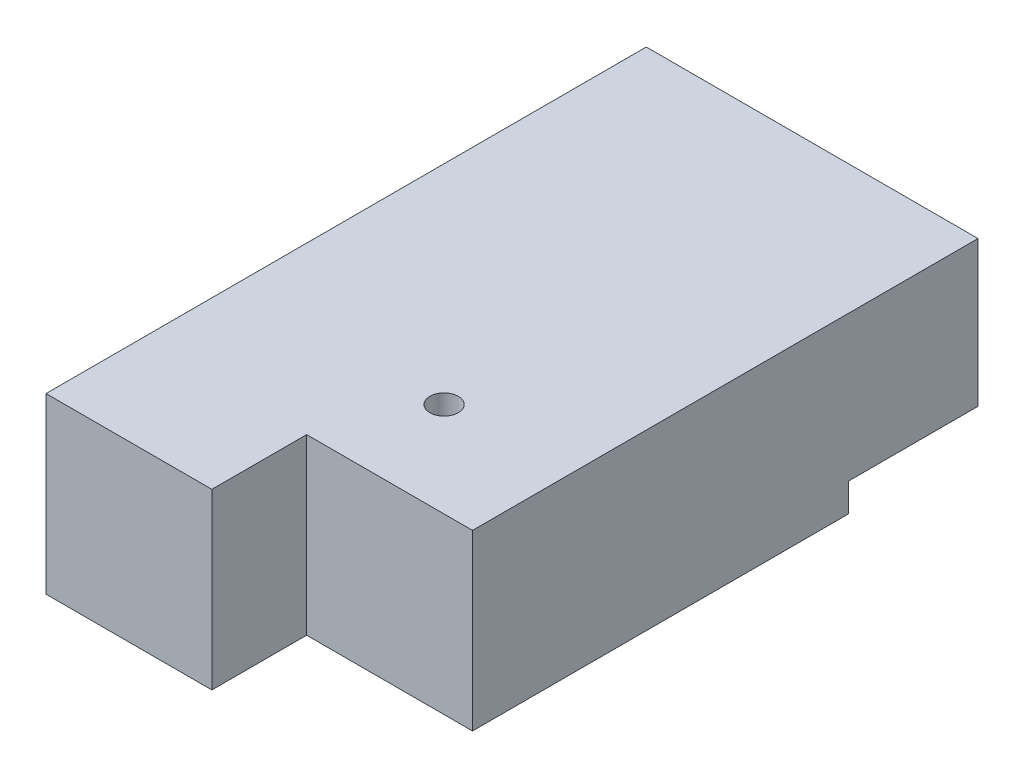
ISO-10303-21;
HEADER;
FILE_DESCRIPTION(('STEP AP214'),'2;1');
FILE_NAME('part.step','',(''),(''),'','','');
FILE_SCHEMA(('AUTOMOTIVE_DESIGN { 1 0 10303 214 1 1 1 1 }'));
ENDSEC;
DATA;
#1=APPLICATION_CONTEXT('core data for automotive mechanical design processes');
#2=APPLICATION_PROTOCOL_DEFINITION('international standard','automotive_design',2000,#1);
#3=PRODUCT_CONTEXT('',#1,'mechanical');
#4=PRODUCT('Part','Part','',(#3));
#5=PRODUCT_RELATED_PRODUCT_CATEGORY('part','',(#4));
#6=PRODUCT_DEFINITION_FORMATION('','',#4);
#7=PRODUCT_DEFINITION_CONTEXT('part definition',#1,'design');
#8=PRODUCT_DEFINITION('design','',#6,#7);
#9=PRODUCT_DEFINITION_SHAPE('','',#8);
#10=(LENGTH_UNIT() NAMED_UNIT(*) SI_UNIT(.MILLI.,.METRE.));
#11=(NAMED_UNIT(*) PLANE_ANGLE_UNIT() SI_UNIT($,.RADIAN.));
#12=(NAMED_UNIT(*) SI_UNIT($,.STERADIAN.) SOLID_ANGLE_UNIT());
#13=UNCERTAINTY_MEASURE_WITH_UNIT(LENGTH_MEASURE(1.E-05),#10,'distance_accuracy_value','');
#14=(GEOMETRIC_REPRESENTATION_CONTEXT(3) GLOBAL_UNCERTAINTY_ASSIGNED_CONTEXT((#13)) GLOBAL_UNIT_ASSIGNED_CONTEXT((#10,
#11,#12)) REPRESENTATION_CONTEXT('',''));
#15=CARTESIAN_POINT('',(0.,0.,0.));
#16=DIRECTION('',(0.,0.,1.));
#17=DIRECTION('',(1.,0.,0.));
#18=AXIS2_PLACEMENT_3D('',#15,#16,#17);
#19=CARTESIAN_POINT('',(10.5,11.,-19.));
#20=DIRECTION('',(-1.,0.,0.));
#21=DIRECTION('',(0.,0.,1.));
#22=AXIS2_PLACEMENT_3D('',#19,#20,#21);
#23=PLANE('',#22);
#24=DIRECTION('',(0.,1.,0.));
#25=VECTOR('',#24,1.);
#26=CARTESIAN_POINT('',(10.5,0.,13.));
#27=LINE('',#26,#25);
#28=CARTESIAN_POINT('',(10.5,0.,13.));
#29=VERTEX_POINT('',#28);
#30=CARTESIAN_POINT('',(10.5,11.,13.));
#31=VERTEX_POINT('',#30);
#32=EDGE_CURVE('E102',#29,#31,#27,.T.);
#33=ORIENTED_EDGE('',*,*,#32,.F.);
#34=DIRECTION('',(0.,0.,-1.));
#35=VECTOR('',#34,1.);
#36=CARTESIAN_POINT('',(10.5,0.,-19.));
#37=LINE('',#36,#35);
#38=CARTESIAN_POINT('',(10.5,0.,-10.8));
#39=VERTEX_POINT('',#38);
#40=EDGE_CURVE('E61',#29,#39,#37,.T.);
#41=ORIENTED_EDGE('',*,*,#40,.T.);
#42=DIRECTION('',(0.,-1.,0.));
#43=VECTOR('',#42,1.);
#44=CARTESIAN_POINT('',(10.5,1.8,-10.8));
#45=LINE('',#44,#43);
#46=CARTESIAN_POINT('',(10.5,1.8,-10.8));
#47=VERTEX_POINT('',#46);
#48=EDGE_CURVE('E135',#47,#39,#45,.T.);
#49=ORIENTED_EDGE('',*,*,#48,.F.);
#50=DIRECTION('',(0.,0.,1.));
#51=VECTOR('',#50,1.);
#52=CARTESIAN_POINT('',(10.5,1.8,-19.));
#53=LINE('',#52,#51);
#54=CARTESIAN_POINT('',(10.5,1.8,-19.));
#55=VERTEX_POINT('',#54);
#56=EDGE_CURVE('E167',#55,#47,#53,.T.);
#57=ORIENTED_EDGE('',*,*,#56,.F.);
#58=DIRECTION('',(0.,-1.,0.));
#59=VECTOR('',#58,1.);
#60=CARTESIAN_POINT('',(10.5,11.,-19.));
#61=LINE('',#60,#59);
#62=CARTESIAN_POINT('',(10.5,11.,-19.));
#63=VERTEX_POINT('',#62);
#64=EDGE_CURVE('E11',#63,#55,#61,.T.);
#65=ORIENTED_EDGE('',*,*,#64,.F.);
#66=DIRECTION('',(0.,0.,-1.));
#67=VECTOR('',#66,1.);
#68=CARTESIAN_POINT('',(10.5,11.,-19.));
#69=LINE('',#68,#67);
#70=EDGE_CURVE('E115',#31,#63,#69,.T.);
#71=ORIENTED_EDGE('',*,*,#70,.F.);
#72=EDGE_LOOP('',(#33,#41,#49,#57,#65,#71));
#73=FACE_BOUND('',#72,.T.);
#74=ADVANCED_FACE('F38',(#73),#23,.F.);
#75=CARTESIAN_POINT('',(-10.5000000000001,11.,-19.));
#76=DIRECTION('',(0.,0.,1.));
#77=DIRECTION('',(1.,0.,0.));
#78=AXIS2_PLACEMENT_3D('',#75,#76,#77);
#79=PLANE('',#78);
#80=ORIENTED_EDGE('',*,*,#64,.T.);
#81=DIRECTION('',(1.,0.,0.));
#82=VECTOR('',#81,1.);
#83=CARTESIAN_POINT('',(-10.5000000000001,1.8,-19.));
#84=LINE('',#83,#82);
#85=CARTESIAN_POINT('',(-10.5000000000001,1.8,-19.));
#86=VERTEX_POINT('',#85);
#87=EDGE_CURVE('E164',#86,#55,#84,.T.);
#88=ORIENTED_EDGE('',*,*,#87,.F.);
#89=DIRECTION('',(0.,-1.,0.));
#90=VECTOR('',#89,1.);
#91=CARTESIAN_POINT('',(-10.5000000000001,11.,-19.));
#92=LINE('',#91,#90);
#93=CARTESIAN_POINT('',(-10.5000000000001,11.,-19.));
#94=VERTEX_POINT('',#93);
#95=EDGE_CURVE('E46',#94,#86,#92,.T.);
#96=ORIENTED_EDGE('',*,*,#95,.F.);
#97=DIRECTION('',(-1.,0.,0.));
#98=VECTOR('',#97,1.);
#99=CARTESIAN_POINT('',(-10.5000000000001,11.,-19.));
#100=LINE('',#99,#98);
#101=EDGE_CURVE('E124',#63,#94,#100,.T.);
#102=ORIENTED_EDGE('',*,*,#101,.F.);
#103=EDGE_LOOP('',(#80,#88,#96,#102));
#104=FACE_BOUND('',#103,.T.);
#105=ADVANCED_FACE('F163',(#104),#79,.F.);
#106=CARTESIAN_POINT('',(-10.5000000000001,11.,-19.));
#107=DIRECTION('',(1.,0.,0.));
#108=DIRECTION('',(0.,0.,-1.));
#109=AXIS2_PLACEMENT_3D('',#106,#107,#108);
#110=PLANE('',#109);
#111=DIRECTION('',(0.,0.,-1.));
#112=VECTOR('',#111,1.);
#113=CARTESIAN_POINT('',(-10.5000000000001,1.8,-19.));
#114=LINE('',#113,#112);
#115=CARTESIAN_POINT('',(-10.5000000000001,1.8,-10.8));
#116=VERTEX_POINT('',#115);
#117=EDGE_CURVE('E159',#116,#86,#114,.T.);
#118=ORIENTED_EDGE('',*,*,#117,.F.);
#119=DIRECTION('',(0.,-1.,0.));
#120=VECTOR('',#119,1.);
#121=CARTESIAN_POINT('',(-10.5000000000001,1.8,-10.8));
#122=LINE('',#121,#120);
#123=CARTESIAN_POINT('',(-10.5000000000001,0.,-10.8));
#124=VERTEX_POINT('',#123);
#125=EDGE_CURVE('E146',#116,#124,#122,.T.);
#126=ORIENTED_EDGE('',*,*,#125,.T.);
#127=DIRECTION('',(0.,0.,1.));
#128=VECTOR('',#127,1.);
#129=CARTESIAN_POINT('',(-10.5000000000001,0.,-19.));
#130=LINE('',#129,#128);
#131=CARTESIAN_POINT('',(-10.5,0.,19.));
#132=VERTEX_POINT('',#131);
#133=EDGE_CURVE('E132',#124,#132,#130,.T.);
#134=ORIENTED_EDGE('',*,*,#133,.T.);
#135=DIRECTION('',(0.,-1.,0.));
#136=VECTOR('',#135,1.);
#137=CARTESIAN_POINT('',(-10.5,11.,19.));
#138=LINE('',#137,#136);
#139=CARTESIAN_POINT('',(-10.5,11.,19.));
#140=VERTEX_POINT('',#139);
#141=EDGE_CURVE('E143',#140,#132,#138,.T.);
#142=ORIENTED_EDGE('',*,*,#141,.F.);
#143=DIRECTION('',(0.,0.,1.));
#144=VECTOR('',#143,1.);
#145=CARTESIAN_POINT('',(-10.5000000000001,11.,-19.));
#146=LINE('',#145,#144);
#147=EDGE_CURVE('E129',#94,#140,#146,.T.);
#148=ORIENTED_EDGE('',*,*,#147,.F.);
#149=ORIENTED_EDGE('',*,*,#95,.T.);
#150=EDGE_LOOP('',(#118,#126,#134,#142,#148,#149));
#151=FACE_BOUND('',#150,.T.);
#152=ADVANCED_FACE('F157',(#151),#110,.F.);
#153=CARTESIAN_POINT('',(-10.5,11.,19.));
#154=DIRECTION('',(0.,0.,-1.));
#155=DIRECTION('',(-1.,0.,0.));
#156=AXIS2_PLACEMENT_3D('',#153,#154,#155);
#157=PLANE('',#156);
#158=DIRECTION('',(1.,0.,0.));
#159=VECTOR('',#158,1.);
#160=CARTESIAN_POINT('',(-10.5,0.,19.));
#161=LINE('',#160,#159);
#162=CARTESIAN_POINT('',(0.,0.,19.));
#163=VERTEX_POINT('',#162);
#164=EDGE_CURVE('E125',#132,#163,#161,.T.);
#165=ORIENTED_EDGE('',*,*,#164,.T.);
#166=DIRECTION('',(0.,-1.,0.));
#167=VECTOR('',#166,1.);
#168=CARTESIAN_POINT('',(0.,0.,19.));
#169=LINE('',#168,#167);
#170=CARTESIAN_POINT('',(0.,11.,19.));
#171=VERTEX_POINT('',#170);
#172=EDGE_CURVE('E111',#171,#163,#169,.T.);
#173=ORIENTED_EDGE('',*,*,#172,.F.);
#174=DIRECTION('',(1.,0.,0.));
#175=VECTOR('',#174,1.);
#176=CARTESIAN_POINT('',(-10.5,11.,19.));
#177=LINE('',#176,#175);
#178=EDGE_CURVE('E140',#140,#171,#177,.T.);
#179=ORIENTED_EDGE('',*,*,#178,.F.);
#180=ORIENTED_EDGE('',*,*,#141,.T.);
#181=EDGE_LOOP('',(#165,#173,#179,#180));
#182=FACE_BOUND('',#181,.T.);
#183=ADVANCED_FACE('F195',(#182),#157,.F.);
#184=CARTESIAN_POINT('',(0.,11.,0.));
#185=DIRECTION('',(0.,1.,0.));
#186=DIRECTION('',(0.,0.,1.));
#187=AXIS2_PLACEMENT_3D('',#184,#185,#186);
#188=PLANE('',#187);
#189=CARTESIAN_POINT('',(2.69999999999995,11.,7.00000000000001));
#190=DIRECTION('',(0.,1.,0.));
#191=DIRECTION('',(0.,0.,1.));
#192=AXIS2_PLACEMENT_3D('',#189,#190,#191);
#193=CIRCLE('',#192,0.9);
#194=CARTESIAN_POINT('',(2.69999999999995,11.,7.90000000000001));
#195=VERTEX_POINT('',#194);
#196=EDGE_CURVE('E203',#195,#195,#193,.T.);
#197=ORIENTED_EDGE('',*,*,#196,.F.);
#198=EDGE_LOOP('',(#197));
#199=FACE_BOUND('',#198,.T.);
#200=DIRECTION('',(0.,0.,1.));
#201=VECTOR('',#200,1.);
#202=CARTESIAN_POINT('',(0.,11.,13.));
#203=LINE('',#202,#201);
#204=CARTESIAN_POINT('',(0.,11.,13.));
#205=VERTEX_POINT('',#204);
#206=EDGE_CURVE('E118',#205,#171,#203,.T.);
#207=ORIENTED_EDGE('',*,*,#206,.F.);
#208=DIRECTION('',(-1.,0.,0.));
#209=VECTOR('',#208,1.);
#210=CARTESIAN_POINT('',(10.5,11.,13.));
#211=LINE('',#210,#209);
#212=EDGE_CURVE('E105',#31,#205,#211,.T.);
#213=ORIENTED_EDGE('',*,*,#212,.F.);
#214=ORIENTED_EDGE('',*,*,#70,.T.);
#215=ORIENTED_EDGE('',*,*,#101,.T.);
#216=ORIENTED_EDGE('',*,*,#147,.T.);
#217=ORIENTED_EDGE('',*,*,#178,.T.);
#218=EDGE_LOOP('',(#207,#213,#214,#215,#216,#217));
#219=FACE_BOUND('',#218,.T.);
#220=ADVANCED_FACE('F114',(#199,#219),#188,.T.);
#221=CARTESIAN_POINT('',(0.,0.,0.));
#222=DIRECTION('',(0.,1.,0.));
#223=DIRECTION('',(0.,0.,1.));
#224=AXIS2_PLACEMENT_3D('',#221,#222,#223);
#225=PLANE('',#224);
#226=CARTESIAN_POINT('',(2.69999999999995,0.,7.00000000000001));
#227=DIRECTION('',(0.,1.,0.));
#228=DIRECTION('',(0.,0.,1.));
#229=AXIS2_PLACEMENT_3D('',#226,#227,#228);
#230=CIRCLE('',#229,0.9);
#231=CARTESIAN_POINT('',(2.69999999999995,0.,7.90000000000001));
#232=VERTEX_POINT('',#231);
#233=EDGE_CURVE('E199',#232,#232,#230,.T.);
#234=ORIENTED_EDGE('',*,*,#233,.T.);
#235=EDGE_LOOP('',(#234));
#236=FACE_BOUND('',#235,.T.);
#237=DIRECTION('',(1.,0.,0.));
#238=VECTOR('',#237,1.);
#239=CARTESIAN_POINT('',(10.5,0.,13.));
#240=LINE('',#239,#238);
#241=CARTESIAN_POINT('',(0.,0.,13.));
#242=VERTEX_POINT('',#241);
#243=EDGE_CURVE('E108',#242,#29,#240,.T.);
#244=ORIENTED_EDGE('',*,*,#243,.F.);
#245=DIRECTION('',(0.,0.,1.));
#246=VECTOR('',#245,1.);
#247=CARTESIAN_POINT('',(0.,0.,13.));
#248=LINE('',#247,#246);
#249=EDGE_CURVE('E181',#242,#163,#248,.T.);
#250=ORIENTED_EDGE('',*,*,#249,.T.);
#251=ORIENTED_EDGE('',*,*,#164,.F.);
#252=ORIENTED_EDGE('',*,*,#133,.F.);
#253=DIRECTION('',(-1.,0.,0.));
#254=VECTOR('',#253,1.);
#255=CARTESIAN_POINT('',(-10.5000000000001,0.,-10.8));
#256=LINE('',#255,#254);
#257=EDGE_CURVE('E173',#39,#124,#256,.T.);
#258=ORIENTED_EDGE('',*,*,#257,.F.);
#259=ORIENTED_EDGE('',*,*,#40,.F.);
#260=EDGE_LOOP('',(#244,#250,#251,#252,#258,#259));
#261=FACE_BOUND('',#260,.T.);
#262=ADVANCED_FACE('F190',(#236,#261),#225,.F.);
#263=CARTESIAN_POINT('',(-10.5000000000001,1.8,-10.8));
#264=DIRECTION('',(0.,0.,1.));
#265=DIRECTION('',(1.,0.,0.));
#266=AXIS2_PLACEMENT_3D('',#263,#264,#265);
#267=PLANE('',#266);
#268=ORIENTED_EDGE('',*,*,#257,.T.);
#269=ORIENTED_EDGE('',*,*,#125,.F.);
#270=DIRECTION('',(-1.,0.,0.));
#271=VECTOR('',#270,1.);
#272=CARTESIAN_POINT('',(-10.5000000000001,1.8,-10.8));
#273=LINE('',#272,#271);
#274=EDGE_CURVE('E171',#47,#116,#273,.T.);
#275=ORIENTED_EDGE('',*,*,#274,.F.);
#276=ORIENTED_EDGE('',*,*,#48,.T.);
#277=EDGE_LOOP('',(#268,#269,#275,#276));
#278=FACE_BOUND('',#277,.T.);
#279=ADVANCED_FACE('F188',(#278),#267,.F.);
#280=CARTESIAN_POINT('',(0.,1.8,0.));
#281=DIRECTION('',(0.,1.,0.));
#282=DIRECTION('',(0.,0.,1.));
#283=AXIS2_PLACEMENT_3D('',#280,#281,#282);
#284=PLANE('',#283);
#285=ORIENTED_EDGE('',*,*,#117,.T.);
#286=ORIENTED_EDGE('',*,*,#87,.T.);
#287=ORIENTED_EDGE('',*,*,#56,.T.);
#288=ORIENTED_EDGE('',*,*,#274,.T.);
#289=EDGE_LOOP('',(#285,#286,#287,#288));
#290=FACE_BOUND('',#289,.T.);
#291=ADVANCED_FACE('F263',(#290),#284,.F.);
#292=CARTESIAN_POINT('',(0.,0.,13.));
#293=DIRECTION('',(-1.,0.,0.));
#294=DIRECTION('',(0.,0.,1.));
#295=AXIS2_PLACEMENT_3D('',#292,#293,#294);
#296=PLANE('',#295);
#297=ORIENTED_EDGE('',*,*,#172,.T.);
#298=ORIENTED_EDGE('',*,*,#249,.F.);
#299=DIRECTION('',(0.,-1.,0.));
#300=VECTOR('',#299,1.);
#301=CARTESIAN_POINT('',(0.,0.,13.));
#302=LINE('',#301,#300);
#303=EDGE_CURVE('E53',#205,#242,#302,.T.);
#304=ORIENTED_EDGE('',*,*,#303,.F.);
#305=ORIENTED_EDGE('',*,*,#206,.T.);
#306=EDGE_LOOP('',(#297,#298,#304,#305));
#307=FACE_BOUND('',#306,.T.);
#308=ADVANCED_FACE('F268',(#307),#296,.F.);
#309=CARTESIAN_POINT('',(0.,0.,13.));
#310=DIRECTION('',(0.,0.,1.));
#311=DIRECTION('',(1.,0.,0.));
#312=AXIS2_PLACEMENT_3D('',#309,#310,#311);
#313=PLANE('',#312);
#314=ORIENTED_EDGE('',*,*,#32,.T.);
#315=ORIENTED_EDGE('',*,*,#212,.T.);
#316=ORIENTED_EDGE('',*,*,#303,.T.);
#317=ORIENTED_EDGE('',*,*,#243,.T.);
#318=EDGE_LOOP('',(#314,#315,#316,#317));
#319=FACE_BOUND('',#318,.T.);
#320=ADVANCED_FACE('F104',(#319),#313,.T.);
#321=CARTESIAN_POINT('',(2.69999999999995,0.,7.00000000000001));
#322=DIRECTION('',(0.,1.,0.));
#323=DIRECTION('',(0.,0.,1.));
#324=AXIS2_PLACEMENT_3D('',#321,#322,#323);
#325=CYLINDRICAL_SURFACE('',#324,0.9);
#326=ORIENTED_EDGE('',*,*,#233,.F.);
#327=EDGE_LOOP('',(#326));
#328=FACE_BOUND('',#327,.T.);
#329=ORIENTED_EDGE('',*,*,#196,.T.);
#330=EDGE_LOOP('',(#329));
#331=FACE_BOUND('',#330,.T.);
#332=ADVANCED_FACE('F217',(#328,#331),#325,.F.);
#333=CLOSED_SHELL('',(#74,#105,#152,#183,#220,#262,#279,#291,#308,#320,#332));
#334=MANIFOLD_SOLID_BREP('B2',#333);
#335=ADVANCED_BREP_SHAPE_REPRESENTATION('',(#18,#334),#14);
#336=SHAPE_DEFINITION_REPRESENTATION(#9,#335);
ENDSEC;
END-ISO-10303-21;
